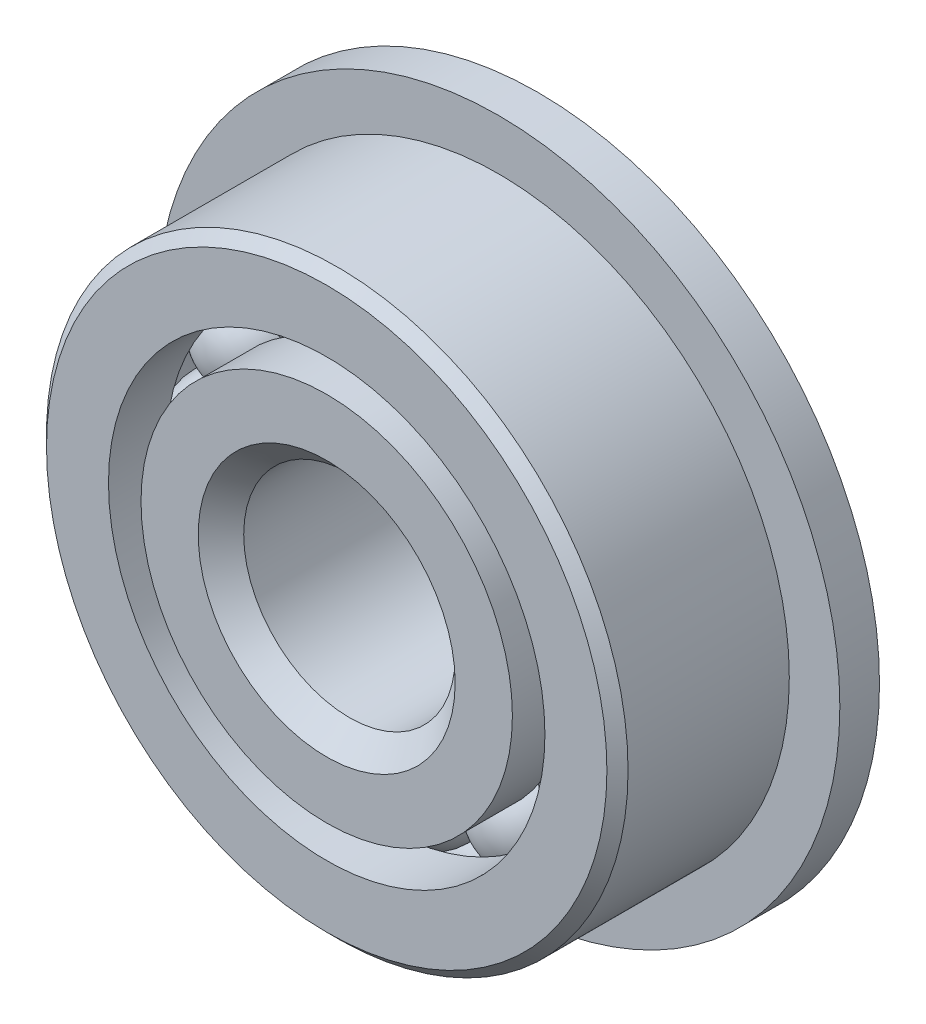
ISO-10303-21;
HEADER;
FILE_DESCRIPTION(('STEP AP214'),'2;1');
FILE_NAME('part.step','',(''),(''),'','','');
FILE_SCHEMA(('AUTOMOTIVE_DESIGN { 1 0 10303 214 1 1 1 1 }'));
ENDSEC;
DATA;
#1=APPLICATION_CONTEXT('core data for automotive mechanical design processes');
#2=APPLICATION_PROTOCOL_DEFINITION('international standard','automotive_design',2000,#1);
#3=PRODUCT_CONTEXT('',#1,'mechanical');
#4=PRODUCT('Part','Part','',(#3));
#5=PRODUCT_RELATED_PRODUCT_CATEGORY('part','',(#4));
#6=PRODUCT_DEFINITION_FORMATION('','',#4);
#7=PRODUCT_DEFINITION_CONTEXT('part definition',#1,'design');
#8=PRODUCT_DEFINITION('design','',#6,#7);
#9=PRODUCT_DEFINITION_SHAPE('','',#8);
#10=(LENGTH_UNIT() NAMED_UNIT(*) SI_UNIT(.MILLI.,.METRE.));
#11=(NAMED_UNIT(*) PLANE_ANGLE_UNIT() SI_UNIT($,.RADIAN.));
#12=(NAMED_UNIT(*) SI_UNIT($,.STERADIAN.) SOLID_ANGLE_UNIT());
#13=UNCERTAINTY_MEASURE_WITH_UNIT(LENGTH_MEASURE(1.E-05),#10,'distance_accuracy_value','');
#14=(GEOMETRIC_REPRESENTATION_CONTEXT(3) GLOBAL_UNCERTAINTY_ASSIGNED_CONTEXT((#13)) GLOBAL_UNIT_ASSIGNED_CONTEXT((#10,
#11,#12)) REPRESENTATION_CONTEXT('',''));
#15=CARTESIAN_POINT('',(0.,0.,0.));
#16=DIRECTION('',(0.,0.,1.));
#17=DIRECTION('',(1.,0.,0.));
#18=AXIS2_PLACEMENT_3D('',#15,#16,#17);
#19=CARTESIAN_POINT('',(-3.03212499999993,5.25179455489982,0.));
#20=DIRECTION('',(0.,0.,1.));
#21=DIRECTION('',(-0.499999999999989,0.866025403784445,0.));
#22=AXIS2_PLACEMENT_3D('',#19,#20,#21);
#23=SPHERICAL_SURFACE('',#22,1.524);
#24=CARTESIAN_POINT('',(-3.03212499999993,5.25179455489982,1.524));
#25=VERTEX_POINT('',#24);
#26=VERTEX_LOOP('',#25);
#27=FACE_BOUND('',#26,.T.);
#28=ADVANCED_FACE('F39',(#27),#23,.T.);
#29=CLOSED_SHELL('',(#28));
#30=MANIFOLD_SOLID_BREP('B2',#29);
#31=CARTESIAN_POINT('',(-5.25179455489975,3.03212500000006,0.));
#32=DIRECTION('',(0.,0.,1.));
#33=DIRECTION('',(-0.866025403784433,0.50000000000001,0.));
#34=AXIS2_PLACEMENT_3D('',#31,#32,#33);
#35=SPHERICAL_SURFACE('',#34,1.524);
#36=CARTESIAN_POINT('',(-5.25179455489975,3.03212500000006,1.524));
#37=VERTEX_POINT('',#36);
#38=VERTEX_LOOP('',#37);
#39=FACE_BOUND('',#38,.T.);
#40=ADVANCED_FACE('F71',(#39),#35,.T.);
#41=CLOSED_SHELL('',(#40));
#42=MANIFOLD_SOLID_BREP('B6',#41);
#43=CARTESIAN_POINT('',(-6.06425,0.,0.));
#44=DIRECTION('',(0.,0.,1.));
#45=DIRECTION('',(-1.,0.,0.));
#46=AXIS2_PLACEMENT_3D('',#43,#44,#45);
#47=SPHERICAL_SURFACE('',#46,1.524);
#48=CARTESIAN_POINT('',(-6.06425,0.,1.524));
#49=VERTEX_POINT('',#48);
#50=VERTEX_LOOP('',#49);
#51=FACE_BOUND('',#50,.T.);
#52=ADVANCED_FACE('F103',(#51),#47,.T.);
#53=CLOSED_SHELL('',(#52));
#54=MANIFOLD_SOLID_BREP('B35',#53);
#55=CARTESIAN_POINT('',(-5.25179455489981,-3.03212499999995,0.));
#56=DIRECTION('',(0.,0.,1.));
#57=DIRECTION('',(-0.866025403784443,-0.499999999999992,0.));
#58=AXIS2_PLACEMENT_3D('',#55,#56,#57);
#59=SPHERICAL_SURFACE('',#58,1.524);
#60=CARTESIAN_POINT('',(-5.25179455489981,-3.03212499999995,1.524));
#61=VERTEX_POINT('',#60);
#62=VERTEX_LOOP('',#61);
#63=FACE_BOUND('',#62,.T.);
#64=ADVANCED_FACE('F133',(#63),#59,.T.);
#65=CLOSED_SHELL('',(#64));
#66=MANIFOLD_SOLID_BREP('B67',#65);
#67=CARTESIAN_POINT('',(-3.03212500000004,-5.25179455489976,0.));
#68=DIRECTION('',(0.,0.,1.));
#69=DIRECTION('',(-0.500000000000007,-0.866025403784435,0.));
#70=AXIS2_PLACEMENT_3D('',#67,#68,#69);
#71=SPHERICAL_SURFACE('',#70,1.524);
#72=CARTESIAN_POINT('',(-3.03212500000004,-5.25179455489976,1.524));
#73=VERTEX_POINT('',#72);
#74=VERTEX_LOOP('',#73);
#75=FACE_BOUND('',#74,.T.);
#76=ADVANCED_FACE('F163',(#75),#71,.T.);
#77=CLOSED_SHELL('',(#76));
#78=MANIFOLD_SOLID_BREP('B99',#77);
#79=CARTESIAN_POINT('',(0.,-6.06425,0.));
#80=DIRECTION('',(0.,0.,1.));
#81=DIRECTION('',(0.,-1.,0.));
#82=AXIS2_PLACEMENT_3D('',#79,#80,#81);
#83=SPHERICAL_SURFACE('',#82,1.524);
#84=CARTESIAN_POINT('',(0.,-6.06425,1.524));
#85=VERTEX_POINT('',#84);
#86=VERTEX_LOOP('',#85);
#87=FACE_BOUND('',#86,.T.);
#88=ADVANCED_FACE('F193',(#87),#83,.T.);
#89=CLOSED_SHELL('',(#88));
#90=MANIFOLD_SOLID_BREP('B129',#89);
#91=CARTESIAN_POINT('',(3.03212499999997,-5.2517945548998,0.));
#92=DIRECTION('',(0.,0.,1.));
#93=DIRECTION('',(0.499999999999995,-0.866025403784442,0.));
#94=AXIS2_PLACEMENT_3D('',#91,#92,#93);
#95=SPHERICAL_SURFACE('',#94,1.524);
#96=CARTESIAN_POINT('',(3.03212499999997,-5.2517945548998,1.524));
#97=VERTEX_POINT('',#96);
#98=VERTEX_LOOP('',#97);
#99=FACE_BOUND('',#98,.T.);
#100=ADVANCED_FACE('F223',(#99),#95,.T.);
#101=CLOSED_SHELL('',(#100));
#102=MANIFOLD_SOLID_BREP('B159',#101);
#103=CARTESIAN_POINT('',(5.25179455489977,-3.03212500000002,0.));
#104=DIRECTION('',(0.,0.,1.));
#105=DIRECTION('',(0.866025403784436,-0.500000000000004,0.));
#106=AXIS2_PLACEMENT_3D('',#103,#104,#105);
#107=SPHERICAL_SURFACE('',#106,1.524);
#108=CARTESIAN_POINT('',(5.25179455489977,-3.03212500000002,1.524));
#109=VERTEX_POINT('',#108);
#110=VERTEX_LOOP('',#109);
#111=FACE_BOUND('',#110,.T.);
#112=ADVANCED_FACE('F253',(#111),#107,.T.);
#113=CLOSED_SHELL('',(#112));
#114=MANIFOLD_SOLID_BREP('B189',#113);
#115=CARTESIAN_POINT('',(6.06425,0.,0.));
#116=DIRECTION('',(0.,0.,1.));
#117=DIRECTION('',(1.,0.,0.));
#118=AXIS2_PLACEMENT_3D('',#115,#116,#117);
#119=SPHERICAL_SURFACE('',#118,1.524);
#120=CARTESIAN_POINT('',(6.06425,0.,1.524));
#121=VERTEX_POINT('',#120);
#122=VERTEX_LOOP('',#121);
#123=FACE_BOUND('',#122,.T.);
#124=ADVANCED_FACE('F283',(#123),#119,.T.);
#125=CLOSED_SHELL('',(#124));
#126=MANIFOLD_SOLID_BREP('B219',#125);
#127=CARTESIAN_POINT('',(5.25179455489979,3.03212499999999,0.));
#128=DIRECTION('',(0.,0.,1.));
#129=DIRECTION('',(0.86602540378444,0.499999999999998,0.));
#130=AXIS2_PLACEMENT_3D('',#127,#128,#129);
#131=SPHERICAL_SURFACE('',#130,1.524);
#132=CARTESIAN_POINT('',(5.25179455489979,3.03212499999999,1.524));
#133=VERTEX_POINT('',#132);
#134=VERTEX_LOOP('',#133);
#135=FACE_BOUND('',#134,.T.);
#136=ADVANCED_FACE('F313',(#135),#131,.T.);
#137=CLOSED_SHELL('',(#136));
#138=MANIFOLD_SOLID_BREP('B249',#137);
#139=CARTESIAN_POINT('',(3.03212500000001,5.25179455489978,0.));
#140=DIRECTION('',(0.,0.,1.));
#141=DIRECTION('',(0.500000000000001,0.866025403784438,0.));
#142=AXIS2_PLACEMENT_3D('',#139,#140,#141);
#143=SPHERICAL_SURFACE('',#142,1.524);
#144=CARTESIAN_POINT('',(3.03212500000001,5.25179455489978,1.524));
#145=VERTEX_POINT('',#144);
#146=VERTEX_LOOP('',#145);
#147=FACE_BOUND('',#146,.T.);
#148=ADVANCED_FACE('F343',(#147),#143,.T.);
#149=CLOSED_SHELL('',(#148));
#150=MANIFOLD_SOLID_BREP('B279',#149);
#151=CARTESIAN_POINT('',(0.,6.06425,0.));
#152=DIRECTION('',(0.,0.,1.));
#153=DIRECTION('',(0.,1.,0.));
#154=AXIS2_PLACEMENT_3D('',#151,#152,#153);
#155=SPHERICAL_SURFACE('',#154,1.524);
#156=CARTESIAN_POINT('',(0.,6.06425,1.524));
#157=VERTEX_POINT('',#156);
#158=VERTEX_LOOP('',#157);
#159=FACE_BOUND('',#158,.T.);
#160=ADVANCED_FACE('F377',(#159),#155,.T.);
#161=CLOSED_SHELL('',(#160));
#162=MANIFOLD_SOLID_BREP('B309',#161);
#163=CARTESIAN_POINT('',(0.,0.,3.175));
#164=DIRECTION('',(0.,0.,1.));
#165=DIRECTION('',(1.,0.,0.));
#166=AXIS2_PLACEMENT_3D('',#163,#164,#165);
#167=CYLINDRICAL_SURFACE('',#166,5.57578846153846);
#168=CARTESIAN_POINT('',(0.,0.,-1.44360012657376));
#169=DIRECTION('',(0.,0.,1.));
#170=DIRECTION('',(1.,0.,0.));
#171=AXIS2_PLACEMENT_3D('',#168,#169,#170);
#172=CIRCLE('',#171,5.57578846153846);
#173=CARTESIAN_POINT('',(5.57578846153846,0.,-1.44360012657376));
#174=VERTEX_POINT('',#173);
#175=EDGE_CURVE('E407',#174,#174,#172,.T.);
#176=ORIENTED_EDGE('',*,*,#175,.F.);
#177=EDGE_LOOP('',(#176));
#178=FACE_BOUND('',#177,.T.);
#179=CARTESIAN_POINT('',(0.,0.,-4.7625));
#180=DIRECTION('',(0.,0.,1.));
#181=DIRECTION('',(1.,0.,0.));
#182=AXIS2_PLACEMENT_3D('',#179,#180,#181);
#183=CIRCLE('',#182,5.57578846153846);
#184=CARTESIAN_POINT('',(5.57578846153846,0.,-4.7625));
#185=VERTEX_POINT('',#184);
#186=EDGE_CURVE('E411',#185,#185,#183,.T.);
#187=ORIENTED_EDGE('',*,*,#186,.T.);
#188=EDGE_LOOP('',(#187));
#189=FACE_BOUND('',#188,.T.);
#190=ADVANCED_FACE('F396',(#178,#189),#167,.T.);
#191=CARTESIAN_POINT('',(0.,3.4925,-4.7625));
#192=DIRECTION('',(0.,0.,1.));
#193=DIRECTION('',(1.,0.,0.));
#194=AXIS2_PLACEMENT_3D('',#191,#192,#193);
#195=PLANE('',#194);
#196=ORIENTED_EDGE('',*,*,#186,.F.);
#197=EDGE_LOOP('',(#196));
#198=FACE_BOUND('',#197,.T.);
#199=CARTESIAN_POINT('',(0.,0.,-4.7625));
#200=DIRECTION('',(0.,0.,1.));
#201=DIRECTION('',(1.,0.,0.));
#202=AXIS2_PLACEMENT_3D('',#199,#200,#201);
#203=CIRCLE('',#202,3.4925);
#204=CARTESIAN_POINT('',(3.4925,0.,-4.7625));
#205=VERTEX_POINT('',#204);
#206=EDGE_CURVE('E416',#205,#205,#203,.T.);
#207=ORIENTED_EDGE('',*,*,#206,.T.);
#208=EDGE_LOOP('',(#207));
#209=FACE_BOUND('',#208,.T.);
#210=ADVANCED_FACE('F443',(#198,#209),#195,.F.);
#211=CARTESIAN_POINT('',(0.,0.,-4.445));
#212=DIRECTION('',(0.,0.,-1.));
#213=DIRECTION('',(-1.,0.,0.));
#214=AXIS2_PLACEMENT_3D('',#211,#212,#213);
#215=CONICAL_SURFACE('',#214,3.175,0.785398163397443);
#216=ORIENTED_EDGE('',*,*,#206,.F.);
#217=EDGE_LOOP('',(#216));
#218=FACE_BOUND('',#217,.T.);
#219=CARTESIAN_POINT('',(0.,0.,-4.445));
#220=DIRECTION('',(0.,0.,1.));
#221=DIRECTION('',(1.,0.,0.));
#222=AXIS2_PLACEMENT_3D('',#219,#220,#221);
#223=CIRCLE('',#222,3.175);
#224=CARTESIAN_POINT('',(3.175,0.,-4.445));
#225=VERTEX_POINT('',#224);
#226=EDGE_CURVE('E419',#225,#225,#223,.T.);
#227=ORIENTED_EDGE('',*,*,#226,.T.);
#228=EDGE_LOOP('',(#227));
#229=FACE_BOUND('',#228,.T.);
#230=ADVANCED_FACE('F449',(#218,#229),#215,.F.);
#231=CARTESIAN_POINT('',(0.,0.,3.175));
#232=DIRECTION('',(0.,0.,1.));
#233=DIRECTION('',(1.,0.,0.));
#234=AXIS2_PLACEMENT_3D('',#231,#232,#233);
#235=CYLINDRICAL_SURFACE('',#234,3.175);
#236=ORIENTED_EDGE('',*,*,#226,.F.);
#237=EDGE_LOOP('',(#236));
#238=FACE_BOUND('',#237,.T.);
#239=CARTESIAN_POINT('',(0.,0.,2.492375));
#240=DIRECTION('',(0.,0.,1.));
#241=DIRECTION('',(1.,0.,0.));
#242=AXIS2_PLACEMENT_3D('',#239,#240,#241);
#243=CIRCLE('',#242,3.175);
#244=CARTESIAN_POINT('',(3.175,0.,2.492375));
#245=VERTEX_POINT('',#244);
#246=EDGE_CURVE('E422',#245,#245,#243,.T.);
#247=ORIENTED_EDGE('',*,*,#246,.T.);
#248=EDGE_LOOP('',(#247));
#249=FACE_BOUND('',#248,.T.);
#250=ADVANCED_FACE('F439',(#238,#249),#235,.F.);
#251=CARTESIAN_POINT('',(0.,0.,3.175));
#252=DIRECTION('',(0.,0.,1.));
#253=DIRECTION('',(1.,0.,0.));
#254=AXIS2_PLACEMENT_3D('',#251,#252,#253);
#255=CONICAL_SURFACE('',#254,3.857625,0.78539816339745);
#256=ORIENTED_EDGE('',*,*,#246,.F.);
#257=EDGE_LOOP('',(#256));
#258=FACE_BOUND('',#257,.T.);
#259=CARTESIAN_POINT('',(0.,0.,3.175));
#260=DIRECTION('',(0.,0.,1.));
#261=DIRECTION('',(1.,0.,0.));
#262=AXIS2_PLACEMENT_3D('',#259,#260,#261);
#263=CIRCLE('',#262,3.857625);
#264=CARTESIAN_POINT('',(3.857625,0.,3.175));
#265=VERTEX_POINT('',#264);
#266=EDGE_CURVE('E425',#265,#265,#263,.T.);
#267=ORIENTED_EDGE('',*,*,#266,.T.);
#268=EDGE_LOOP('',(#267));
#269=FACE_BOUND('',#268,.T.);
#270=ADVANCED_FACE('F429',(#258,#269),#255,.F.);
#271=CARTESIAN_POINT('',(0.,5.57578846153846,3.175));
#272=DIRECTION('',(0.,0.,-1.));
#273=DIRECTION('',(-1.,0.,0.));
#274=AXIS2_PLACEMENT_3D('',#271,#272,#273);
#275=PLANE('',#274);
#276=CARTESIAN_POINT('',(0.,0.,3.175));
#277=DIRECTION('',(0.,0.,1.));
#278=DIRECTION('',(1.,0.,0.));
#279=AXIS2_PLACEMENT_3D('',#276,#277,#278);
#280=CIRCLE('',#279,5.57578846153846);
#281=CARTESIAN_POINT('',(5.57578846153846,0.,3.175));
#282=VERTEX_POINT('',#281);
#283=EDGE_CURVE('E403',#282,#282,#280,.T.);
#284=ORIENTED_EDGE('',*,*,#283,.T.);
#285=EDGE_LOOP('',(#284));
#286=FACE_BOUND('',#285,.T.);
#287=ORIENTED_EDGE('',*,*,#266,.F.);
#288=EDGE_LOOP('',(#287));
#289=FACE_BOUND('',#288,.T.);
#290=ADVANCED_FACE('F398',(#286,#289),#275,.F.);
#291=CARTESIAN_POINT('',(0.,0.,0.));
#292=DIRECTION('',(0.,0.,1.));
#293=DIRECTION('',(1.,0.,0.));
#294=AXIS2_PLACEMENT_3D('',#291,#292,#293);
#295=TOROIDAL_SURFACE('',#294,6.06425,1.524);
#296=CARTESIAN_POINT('',(0.,0.,1.44360012657376));
#297=DIRECTION('',(0.,0.,1.));
#298=DIRECTION('',(1.,0.,0.));
#299=AXIS2_PLACEMENT_3D('',#296,#297,#298);
#300=CIRCLE('',#299,5.57578846153846);
#301=CARTESIAN_POINT('',(5.57578846153846,0.,1.44360012657376));
#302=VERTEX_POINT('',#301);
#303=EDGE_CURVE('E376',#302,#302,#300,.T.);
#304=ORIENTED_EDGE('',*,*,#303,.F.);
#305=EDGE_LOOP('',(#304));
#306=FACE_BOUND('',#305,.T.);
#307=ORIENTED_EDGE('',*,*,#175,.T.);
#308=EDGE_LOOP('',(#307));
#309=FACE_BOUND('',#308,.T.);
#310=ADVANCED_FACE('F432',(#306,#309),#295,.F.);
#311=CARTESIAN_POINT('',(0.,0.,3.175));
#312=DIRECTION('',(0.,0.,1.));
#313=DIRECTION('',(1.,0.,0.));
#314=AXIS2_PLACEMENT_3D('',#311,#312,#313);
#315=CYLINDRICAL_SURFACE('',#314,5.57578846153846);
#316=ORIENTED_EDGE('',*,*,#283,.F.);
#317=EDGE_LOOP('',(#316));
#318=FACE_BOUND('',#317,.T.);
#319=ORIENTED_EDGE('',*,*,#303,.T.);
#320=EDGE_LOOP('',(#319));
#321=FACE_BOUND('',#320,.T.);
#322=ADVANCED_FACE('F437',(#318,#321),#315,.T.);
#323=CLOSED_SHELL('',(#190,#210,#230,#250,#270,#290,#310,#322));
#324=MANIFOLD_SOLID_BREP('B339',#323);
#325=CARTESIAN_POINT('',(0.,0.,2.8575));
#326=DIRECTION('',(0.,0.,-1.));
#327=DIRECTION('',(-1.,0.,0.));
#328=AXIS2_PLACEMENT_3D('',#325,#326,#327);
#329=CONICAL_SURFACE('',#328,8.73125,0.785398163397446);
#330=CARTESIAN_POINT('',(0.,0.,3.175));
#331=DIRECTION('',(0.,0.,1.));
#332=DIRECTION('',(1.,0.,0.));
#333=AXIS2_PLACEMENT_3D('',#330,#331,#332);
#334=CIRCLE('',#333,8.41375);
#335=CARTESIAN_POINT('',(8.41375,0.,3.175));
#336=VERTEX_POINT('',#335);
#337=EDGE_CURVE('E545',#336,#336,#334,.T.);
#338=ORIENTED_EDGE('',*,*,#337,.F.);
#339=EDGE_LOOP('',(#338));
#340=FACE_BOUND('',#339,.T.);
#341=CARTESIAN_POINT('',(0.,0.,2.8575));
#342=DIRECTION('',(0.,0.,1.));
#343=DIRECTION('',(1.,0.,0.));
#344=AXIS2_PLACEMENT_3D('',#341,#342,#343);
#345=CIRCLE('',#344,8.73125);
#346=CARTESIAN_POINT('',(8.73125,0.,2.8575));
#347=VERTEX_POINT('',#346);
#348=EDGE_CURVE('E395',#347,#347,#345,.T.);
#349=ORIENTED_EDGE('',*,*,#348,.T.);
#350=EDGE_LOOP('',(#349));
#351=FACE_BOUND('',#350,.T.);
#352=ADVANCED_FACE('F523',(#340,#351),#329,.T.);
#353=CARTESIAN_POINT('',(0.,0.,3.175));
#354=DIRECTION('',(0.,0.,1.));
#355=DIRECTION('',(1.,0.,0.));
#356=AXIS2_PLACEMENT_3D('',#353,#354,#355);
#357=CYLINDRICAL_SURFACE('',#356,8.73125);
#358=CARTESIAN_POINT('',(0.,0.,-1.984375));
#359=DIRECTION('',(0.,0.,1.));
#360=DIRECTION('',(1.,0.,0.));
#361=AXIS2_PLACEMENT_3D('',#358,#359,#360);
#362=CIRCLE('',#361,8.73125);
#363=CARTESIAN_POINT('',(8.73125,0.,-1.984375));
#364=VERTEX_POINT('',#363);
#365=EDGE_CURVE('E526',#364,#364,#362,.T.);
#366=ORIENTED_EDGE('',*,*,#365,.T.);
#367=EDGE_LOOP('',(#366));
#368=FACE_BOUND('',#367,.T.);
#369=ORIENTED_EDGE('',*,*,#348,.F.);
#370=EDGE_LOOP('',(#369));
#371=FACE_BOUND('',#370,.T.);
#372=ADVANCED_FACE('F566',(#368,#371),#357,.T.);
#373=CARTESIAN_POINT('',(0.,8.41375,-3.175));
#374=DIRECTION('',(0.,0.,1.));
#375=DIRECTION('',(1.,0.,0.));
#376=AXIS2_PLACEMENT_3D('',#373,#374,#375);
#377=PLANE('',#376);
#378=CARTESIAN_POINT('',(0.,0.,-3.175));
#379=DIRECTION('',(0.,0.,1.));
#380=DIRECTION('',(1.,0.,0.));
#381=AXIS2_PLACEMENT_3D('',#378,#379,#380);
#382=CIRCLE('',#381,6.55271153846154);
#383=CARTESIAN_POINT('',(6.55271153846154,0.,-3.175));
#384=VERTEX_POINT('',#383);
#385=EDGE_CURVE('E530',#384,#384,#382,.T.);
#386=ORIENTED_EDGE('',*,*,#385,.T.);
#387=EDGE_LOOP('',(#386));
#388=FACE_BOUND('',#387,.T.);
#389=CARTESIAN_POINT('',(0.,0.,-3.175));
#390=DIRECTION('',(0.,0.,-1.));
#391=DIRECTION('',(-1.,0.,0.));
#392=AXIS2_PLACEMENT_3D('',#389,#390,#391);
#393=CIRCLE('',#392,10.2489);
#394=CARTESIAN_POINT('',(-10.2489,0.,-3.175));
#395=VERTEX_POINT('',#394);
#396=EDGE_CURVE('E548',#395,#395,#393,.T.);
#397=ORIENTED_EDGE('',*,*,#396,.T.);
#398=EDGE_LOOP('',(#397));
#399=FACE_BOUND('',#398,.T.);
#400=ADVANCED_FACE('F569',(#388,#399),#377,.F.);
#401=CARTESIAN_POINT('',(0.,0.,3.175));
#402=DIRECTION('',(0.,0.,1.));
#403=DIRECTION('',(1.,0.,0.));
#404=AXIS2_PLACEMENT_3D('',#401,#402,#403);
#405=CYLINDRICAL_SURFACE('',#404,6.55271153846154);
#406=ORIENTED_EDGE('',*,*,#385,.F.);
#407=EDGE_LOOP('',(#406));
#408=FACE_BOUND('',#407,.T.);
#409=CARTESIAN_POINT('',(0.,0.,-1.44360012657376));
#410=DIRECTION('',(0.,0.,1.));
#411=DIRECTION('',(1.,0.,0.));
#412=AXIS2_PLACEMENT_3D('',#409,#410,#411);
#413=CIRCLE('',#412,6.55271153846154);
#414=CARTESIAN_POINT('',(6.55271153846154,0.,-1.44360012657376));
#415=VERTEX_POINT('',#414);
#416=EDGE_CURVE('E534',#415,#415,#413,.T.);
#417=ORIENTED_EDGE('',*,*,#416,.T.);
#418=EDGE_LOOP('',(#417));
#419=FACE_BOUND('',#418,.T.);
#420=ADVANCED_FACE('F574',(#408,#419),#405,.F.);
#421=CARTESIAN_POINT('',(0.,0.,0.));
#422=DIRECTION('',(0.,0.,1.));
#423=DIRECTION('',(1.,0.,0.));
#424=AXIS2_PLACEMENT_3D('',#421,#422,#423);
#425=TOROIDAL_SURFACE('',#424,6.06425,1.524);
#426=ORIENTED_EDGE('',*,*,#416,.F.);
#427=EDGE_LOOP('',(#426));
#428=FACE_BOUND('',#427,.T.);
#429=CARTESIAN_POINT('',(0.,0.,1.44360012657376));
#430=DIRECTION('',(0.,0.,1.));
#431=DIRECTION('',(1.,0.,0.));
#432=AXIS2_PLACEMENT_3D('',#429,#430,#431);
#433=CIRCLE('',#432,6.55271153846154);
#434=CARTESIAN_POINT('',(6.55271153846154,0.,1.44360012657376));
#435=VERTEX_POINT('',#434);
#436=EDGE_CURVE('E539',#435,#435,#433,.T.);
#437=ORIENTED_EDGE('',*,*,#436,.T.);
#438=EDGE_LOOP('',(#437));
#439=FACE_BOUND('',#438,.T.);
#440=ADVANCED_FACE('F581',(#428,#439),#425,.F.);
#441=CARTESIAN_POINT('',(0.,0.,3.175));
#442=DIRECTION('',(0.,0.,1.));
#443=DIRECTION('',(1.,0.,0.));
#444=AXIS2_PLACEMENT_3D('',#441,#442,#443);
#445=CYLINDRICAL_SURFACE('',#444,6.55271153846154);
#446=ORIENTED_EDGE('',*,*,#436,.F.);
#447=EDGE_LOOP('',(#446));
#448=FACE_BOUND('',#447,.T.);
#449=CARTESIAN_POINT('',(0.,0.,3.175));
#450=DIRECTION('',(0.,0.,1.));
#451=DIRECTION('',(1.,0.,0.));
#452=AXIS2_PLACEMENT_3D('',#449,#450,#451);
#453=CIRCLE('',#452,6.55271153846154);
#454=CARTESIAN_POINT('',(6.55271153846154,0.,3.175));
#455=VERTEX_POINT('',#454);
#456=EDGE_CURVE('E542',#455,#455,#453,.T.);
#457=ORIENTED_EDGE('',*,*,#456,.T.);
#458=EDGE_LOOP('',(#457));
#459=FACE_BOUND('',#458,.T.);
#460=ADVANCED_FACE('F585',(#448,#459),#445,.F.);
#461=CARTESIAN_POINT('',(0.,8.41375,3.175));
#462=DIRECTION('',(0.,0.,-1.));
#463=DIRECTION('',(-1.,0.,0.));
#464=AXIS2_PLACEMENT_3D('',#461,#462,#463);
#465=PLANE('',#464);
#466=ORIENTED_EDGE('',*,*,#456,.F.);
#467=EDGE_LOOP('',(#466));
#468=FACE_BOUND('',#467,.T.);
#469=ORIENTED_EDGE('',*,*,#337,.T.);
#470=EDGE_LOOP('',(#469));
#471=FACE_BOUND('',#470,.T.);
#472=ADVANCED_FACE('F561',(#468,#471),#465,.F.);
#473=CARTESIAN_POINT('',(0.,7.48323076923077,-1.984375));
#474=DIRECTION('',(0.,0.,1.));
#475=DIRECTION('',(1.,0.,0.));
#476=AXIS2_PLACEMENT_3D('',#473,#474,#475);
#477=PLANE('',#476);
#478=CARTESIAN_POINT('',(0.,0.,-1.984375));
#479=DIRECTION('',(0.,0.,-1.));
#480=DIRECTION('',(-1.,0.,0.));
#481=AXIS2_PLACEMENT_3D('',#478,#479,#480);
#482=CIRCLE('',#481,10.2489);
#483=CARTESIAN_POINT('',(-10.2489,0.,-1.984375));
#484=VERTEX_POINT('',#483);
#485=EDGE_CURVE('E551',#484,#484,#482,.T.);
#486=ORIENTED_EDGE('',*,*,#485,.F.);
#487=EDGE_LOOP('',(#486));
#488=FACE_BOUND('',#487,.T.);
#489=ORIENTED_EDGE('',*,*,#365,.F.);
#490=EDGE_LOOP('',(#489));
#491=FACE_BOUND('',#490,.T.);
#492=ADVANCED_FACE('F558',(#488,#491),#477,.T.);
#493=CARTESIAN_POINT('',(0.,0.,-4.7625));
#494=DIRECTION('',(0.,0.,-1.));
#495=DIRECTION('',(-1.,0.,0.));
#496=AXIS2_PLACEMENT_3D('',#493,#494,#495);
#497=CYLINDRICAL_SURFACE('',#496,10.2489);
#498=ORIENTED_EDGE('',*,*,#485,.T.);
#499=EDGE_LOOP('',(#498));
#500=FACE_BOUND('',#499,.T.);
#501=ORIENTED_EDGE('',*,*,#396,.F.);
#502=EDGE_LOOP('',(#501));
#503=FACE_BOUND('',#502,.T.);
#504=ADVANCED_FACE('F555',(#500,#503),#497,.T.);
#505=CLOSED_SHELL('',(#352,#372,#400,#420,#440,#460,#472,#492,#504));
#506=MANIFOLD_SOLID_BREP('B371',#505);
#507=ADVANCED_BREP_SHAPE_REPRESENTATION('',(#18,#30,#42,#54,#66,#78,#90,#102,#114,#126,#138,
#150,#162,#324,#506),#14);
#508=SHAPE_DEFINITION_REPRESENTATION(#9,#507);
ENDSEC;
END-ISO-10303-21;
